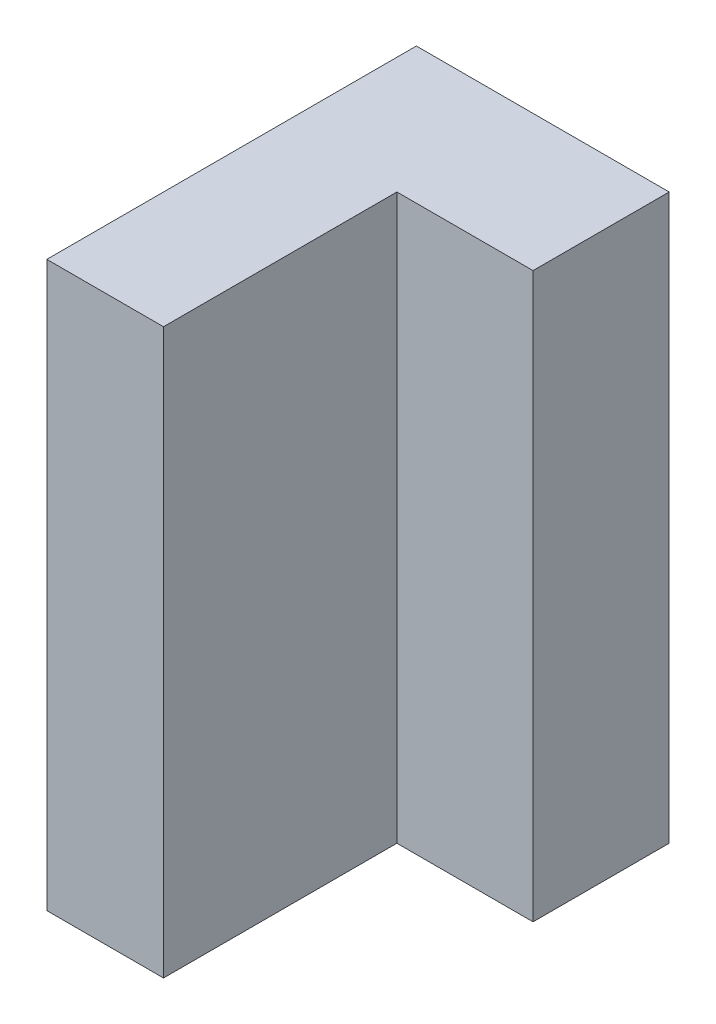
ISO-10303-21;
HEADER;
FILE_DESCRIPTION(('STEP AP214'),'2;1');
FILE_NAME('part.step','',(''),(''),'','','');
FILE_SCHEMA(('AUTOMOTIVE_DESIGN { 1 0 10303 214 1 1 1 1 }'));
ENDSEC;
DATA;
#1=APPLICATION_CONTEXT('core data for automotive mechanical design processes');
#2=APPLICATION_PROTOCOL_DEFINITION('international standard','automotive_design',2000,#1);
#3=PRODUCT_CONTEXT('',#1,'mechanical');
#4=PRODUCT('Part','Part','',(#3));
#5=PRODUCT_RELATED_PRODUCT_CATEGORY('part','',(#4));
#6=PRODUCT_DEFINITION_FORMATION('','',#4);
#7=PRODUCT_DEFINITION_CONTEXT('part definition',#1,'design');
#8=PRODUCT_DEFINITION('design','',#6,#7);
#9=PRODUCT_DEFINITION_SHAPE('','',#8);
#10=(LENGTH_UNIT() NAMED_UNIT(*) SI_UNIT(.MILLI.,.METRE.));
#11=(NAMED_UNIT(*) PLANE_ANGLE_UNIT() SI_UNIT($,.RADIAN.));
#12=(NAMED_UNIT(*) SI_UNIT($,.STERADIAN.) SOLID_ANGLE_UNIT());
#13=UNCERTAINTY_MEASURE_WITH_UNIT(LENGTH_MEASURE(1.E-05),#10,'distance_accuracy_value','');
#14=(GEOMETRIC_REPRESENTATION_CONTEXT(3) GLOBAL_UNCERTAINTY_ASSIGNED_CONTEXT((#13)) GLOBAL_UNIT_ASSIGNED_CONTEXT((#10,
#11,#12)) REPRESENTATION_CONTEXT('',''));
#15=CARTESIAN_POINT('',(0.,0.,0.));
#16=DIRECTION('',(0.,0.,1.));
#17=DIRECTION('',(1.,0.,0.));
#18=AXIS2_PLACEMENT_3D('',#15,#16,#17);
#19=CARTESIAN_POINT('',(0.3,0.,0.35));
#20=DIRECTION('',(0.,0.,1.));
#21=DIRECTION('',(1.,0.,0.));
#22=AXIS2_PLACEMENT_3D('',#19,#20,#21);
#23=PLANE('',#22);
#24=DIRECTION('',(0.,1.,0.));
#25=VECTOR('',#24,1.);
#26=CARTESIAN_POINT('',(0.3,0.,0.35));
#27=LINE('',#26,#25);
#28=CARTESIAN_POINT('',(0.3,0.,0.35));
#29=VERTEX_POINT('',#28);
#30=CARTESIAN_POINT('',(0.3,1.450000047684,0.35));
#31=VERTEX_POINT('',#30);
#32=EDGE_CURVE('E85',#29,#31,#27,.T.);
#33=ORIENTED_EDGE('',*,*,#32,.F.);
#34=DIRECTION('',(1.,0.,0.));
#35=VECTOR('',#34,1.);
#36=CARTESIAN_POINT('',(0.3,0.,0.35));
#37=LINE('',#36,#35);
#38=CARTESIAN_POINT('',(0.649999976158,0.,0.35));
#39=VERTEX_POINT('',#38);
#40=EDGE_CURVE('E66',#29,#39,#37,.T.);
#41=ORIENTED_EDGE('',*,*,#40,.T.);
#42=DIRECTION('',(0.,1.,0.));
#43=VECTOR('',#42,1.);
#44=CARTESIAN_POINT('',(0.649999976158,0.,0.35));
#45=LINE('',#44,#43);
#46=CARTESIAN_POINT('',(0.649999976158,1.450000047684,0.35));
#47=VERTEX_POINT('',#46);
#48=EDGE_CURVE('E74',#47,#39,#45,.F.);
#49=ORIENTED_EDGE('',*,*,#48,.F.);
#50=DIRECTION('',(1.,0.,0.));
#51=VECTOR('',#50,1.);
#52=CARTESIAN_POINT('',(0.3,1.450000047684,0.35));
#53=LINE('',#52,#51);
#54=EDGE_CURVE('E19',#47,#31,#53,.F.);
#55=ORIENTED_EDGE('',*,*,#54,.T.);
#56=EDGE_LOOP('',(#33,#41,#49,#55));
#57=FACE_BOUND('',#56,.T.);
#58=ADVANCED_FACE('F16',(#57),#23,.T.);
#59=CARTESIAN_POINT('',(0.649999976158,0.,0.));
#60=DIRECTION('',(1.,0.,0.));
#61=DIRECTION('',(0.,0.,-1.));
#62=AXIS2_PLACEMENT_3D('',#59,#60,#61);
#63=PLANE('',#62);
#64=DIRECTION('',(0.,0.,1.));
#65=VECTOR('',#64,1.);
#66=CARTESIAN_POINT('',(0.649999976158,0.,0.));
#67=LINE('',#66,#65);
#68=CARTESIAN_POINT('',(0.649999976158,0.,0.));
#69=VERTEX_POINT('',#68);
#70=EDGE_CURVE('E87',#39,#69,#67,.F.);
#71=ORIENTED_EDGE('',*,*,#70,.T.);
#72=DIRECTION('',(0.,1.,0.));
#73=VECTOR('',#72,1.);
#74=CARTESIAN_POINT('',(0.649999976158,0.,0.));
#75=LINE('',#74,#73);
#76=CARTESIAN_POINT('',(0.649999976158,1.450000047684,0.));
#77=VERTEX_POINT('',#76);
#78=EDGE_CURVE('E77',#69,#77,#75,.T.);
#79=ORIENTED_EDGE('',*,*,#78,.T.);
#80=DIRECTION('',(0.,0.,-1.));
#81=VECTOR('',#80,1.);
#82=CARTESIAN_POINT('',(0.649999976158,1.450000047684,0.));
#83=LINE('',#82,#81);
#84=EDGE_CURVE('E71',#77,#47,#83,.F.);
#85=ORIENTED_EDGE('',*,*,#84,.T.);
#86=ORIENTED_EDGE('',*,*,#48,.T.);
#87=EDGE_LOOP('',(#71,#79,#85,#86));
#88=FACE_BOUND('',#87,.T.);
#89=ADVANCED_FACE('F73',(#88),#63,.T.);
#90=CARTESIAN_POINT('',(0.3,0.,0.35));
#91=DIRECTION('',(1.,0.,0.));
#92=DIRECTION('',(0.,0.,-1.));
#93=AXIS2_PLACEMENT_3D('',#90,#91,#92);
#94=PLANE('',#93);
#95=DIRECTION('',(0.,0.,1.));
#96=VECTOR('',#95,1.);
#97=CARTESIAN_POINT('',(0.3,1.450000047684,0.));
#98=LINE('',#97,#96);
#99=CARTESIAN_POINT('',(0.3,1.450000047684,0.94999999701975));
#100=VERTEX_POINT('',#99);
#101=EDGE_CURVE('E83',#100,#31,#98,.F.);
#102=ORIENTED_EDGE('',*,*,#101,.F.);
#103=DIRECTION('',(0.,1.,0.));
#104=VECTOR('',#103,1.);
#105=CARTESIAN_POINT('',(0.3,0.,0.949999988079));
#106=LINE('',#105,#104);
#107=CARTESIAN_POINT('',(0.3,0.,0.94999999701975));
#108=VERTEX_POINT('',#107);
#109=EDGE_CURVE('E105',#108,#100,#106,.T.);
#110=ORIENTED_EDGE('',*,*,#109,.F.);
#111=DIRECTION('',(0.,0.,1.));
#112=VECTOR('',#111,1.);
#113=CARTESIAN_POINT('',(0.3,0.,0.));
#114=LINE('',#113,#112);
#115=EDGE_CURVE('E91',#108,#29,#114,.F.);
#116=ORIENTED_EDGE('',*,*,#115,.T.);
#117=ORIENTED_EDGE('',*,*,#32,.T.);
#118=EDGE_LOOP('',(#102,#110,#116,#117));
#119=FACE_BOUND('',#118,.T.);
#120=ADVANCED_FACE('F139',(#119),#94,.T.);
#121=CARTESIAN_POINT('',(0.,0.,0.));
#122=DIRECTION('',(0.,1.,0.));
#123=DIRECTION('',(0.,0.,1.));
#124=AXIS2_PLACEMENT_3D('',#121,#122,#123);
#125=PLANE('',#124);
#126=ORIENTED_EDGE('',*,*,#115,.F.);
#127=DIRECTION('',(1.,0.,0.));
#128=VECTOR('',#127,1.);
#129=CARTESIAN_POINT('',(0.,0.,0.949999988079));
#130=LINE('',#129,#128);
#131=CARTESIAN_POINT('',(0.,0.,0.949999988079));
#132=VERTEX_POINT('',#131);
#133=EDGE_CURVE('E102',#132,#108,#130,.T.);
#134=ORIENTED_EDGE('',*,*,#133,.F.);
#135=DIRECTION('',(0.,0.,-1.));
#136=VECTOR('',#135,1.);
#137=CARTESIAN_POINT('',(0.,0.,0.));
#138=LINE('',#137,#136);
#139=CARTESIAN_POINT('',(0.,0.,0.));
#140=VERTEX_POINT('',#139);
#141=EDGE_CURVE('E107',#132,#140,#138,.T.);
#142=ORIENTED_EDGE('',*,*,#141,.T.);
#143=DIRECTION('',(1.,0.,0.));
#144=VECTOR('',#143,1.);
#145=CARTESIAN_POINT('',(0.,0.,0.));
#146=LINE('',#145,#144);
#147=EDGE_CURVE('E94',#140,#69,#146,.T.);
#148=ORIENTED_EDGE('',*,*,#147,.T.);
#149=ORIENTED_EDGE('',*,*,#70,.F.);
#150=ORIENTED_EDGE('',*,*,#40,.F.);
#151=EDGE_LOOP('',(#126,#134,#142,#148,#149,#150));
#152=FACE_BOUND('',#151,.T.);
#153=ADVANCED_FACE('F121',(#152),#125,.F.);
#154=CARTESIAN_POINT('',(0.,0.,0.));
#155=DIRECTION('',(0.,0.,1.));
#156=DIRECTION('',(1.,0.,0.));
#157=AXIS2_PLACEMENT_3D('',#154,#155,#156);
#158=PLANE('',#157);
#159=ORIENTED_EDGE('',*,*,#78,.F.);
#160=ORIENTED_EDGE('',*,*,#147,.F.);
#161=DIRECTION('',(0.,1.,0.));
#162=VECTOR('',#161,1.);
#163=CARTESIAN_POINT('',(0.,0.,0.));
#164=LINE('',#163,#162);
#165=CARTESIAN_POINT('',(0.,1.450000047684,0.));
#166=VERTEX_POINT('',#165);
#167=EDGE_CURVE('E110',#140,#166,#164,.T.);
#168=ORIENTED_EDGE('',*,*,#167,.T.);
#169=DIRECTION('',(1.,0.,0.));
#170=VECTOR('',#169,1.);
#171=CARTESIAN_POINT('',(0.,1.450000047684,0.));
#172=LINE('',#171,#170);
#173=EDGE_CURVE('E98',#77,#166,#172,.F.);
#174=ORIENTED_EDGE('',*,*,#173,.F.);
#175=EDGE_LOOP('',(#159,#160,#168,#174));
#176=FACE_BOUND('',#175,.T.);
#177=ADVANCED_FACE('F119',(#176),#158,.F.);
#178=CARTESIAN_POINT('',(0.,1.450000047684,0.));
#179=DIRECTION('',(0.,1.,0.));
#180=DIRECTION('',(0.,0.,1.));
#181=AXIS2_PLACEMENT_3D('',#178,#179,#180);
#182=PLANE('',#181);
#183=ORIENTED_EDGE('',*,*,#101,.T.);
#184=ORIENTED_EDGE('',*,*,#54,.F.);
#185=ORIENTED_EDGE('',*,*,#84,.F.);
#186=ORIENTED_EDGE('',*,*,#173,.T.);
#187=DIRECTION('',(0.,0.,-1.));
#188=VECTOR('',#187,1.);
#189=CARTESIAN_POINT('',(0.,1.450000047684,0.));
#190=LINE('',#189,#188);
#191=CARTESIAN_POINT('',(0.,1.450000047684,0.949999988079));
#192=VERTEX_POINT('',#191);
#193=EDGE_CURVE('E25',#166,#192,#190,.F.);
#194=ORIENTED_EDGE('',*,*,#193,.T.);
#195=DIRECTION('',(1.,0.,0.));
#196=VECTOR('',#195,1.);
#197=CARTESIAN_POINT('',(0.,1.450000047684,0.949999988079));
#198=LINE('',#197,#196);
#199=EDGE_CURVE('E33',#100,#192,#198,.F.);
#200=ORIENTED_EDGE('',*,*,#199,.F.);
#201=EDGE_LOOP('',(#183,#184,#185,#186,#194,#200));
#202=FACE_BOUND('',#201,.T.);
#203=ADVANCED_FACE('F82',(#202),#182,.T.);
#204=CARTESIAN_POINT('',(0.,0.,0.949999988079));
#205=DIRECTION('',(0.,0.,1.));
#206=DIRECTION('',(1.,0.,0.));
#207=AXIS2_PLACEMENT_3D('',#204,#205,#206);
#208=PLANE('',#207);
#209=ORIENTED_EDGE('',*,*,#133,.T.);
#210=ORIENTED_EDGE('',*,*,#109,.T.);
#211=ORIENTED_EDGE('',*,*,#199,.T.);
#212=DIRECTION('',(0.,1.,0.));
#213=VECTOR('',#212,1.);
#214=CARTESIAN_POINT('',(0.,0.,0.949999988079));
#215=LINE('',#214,#213);
#216=EDGE_CURVE('E10',#192,#132,#215,.F.);
#217=ORIENTED_EDGE('',*,*,#216,.T.);
#218=EDGE_LOOP('',(#209,#210,#211,#217));
#219=FACE_BOUND('',#218,.T.);
#220=ADVANCED_FACE('F124',(#219),#208,.T.);
#221=CARTESIAN_POINT('',(0.,0.,0.));
#222=DIRECTION('',(1.,0.,0.));
#223=DIRECTION('',(0.,0.,-1.));
#224=AXIS2_PLACEMENT_3D('',#221,#222,#223);
#225=PLANE('',#224);
#226=ORIENTED_EDGE('',*,*,#193,.F.);
#227=ORIENTED_EDGE('',*,*,#167,.F.);
#228=ORIENTED_EDGE('',*,*,#141,.F.);
#229=ORIENTED_EDGE('',*,*,#216,.F.);
#230=EDGE_LOOP('',(#226,#227,#228,#229));
#231=FACE_BOUND('',#230,.T.);
#232=ADVANCED_FACE('F117',(#231),#225,.F.);
#233=CLOSED_SHELL('',(#58,#89,#120,#153,#177,#203,#220,#232));
#234=MANIFOLD_SOLID_BREP('B1',#233);
#235=ADVANCED_BREP_SHAPE_REPRESENTATION('',(#18,#234),#14);
#236=SHAPE_DEFINITION_REPRESENTATION(#9,#235);
ENDSEC;
END-ISO-10303-21;
